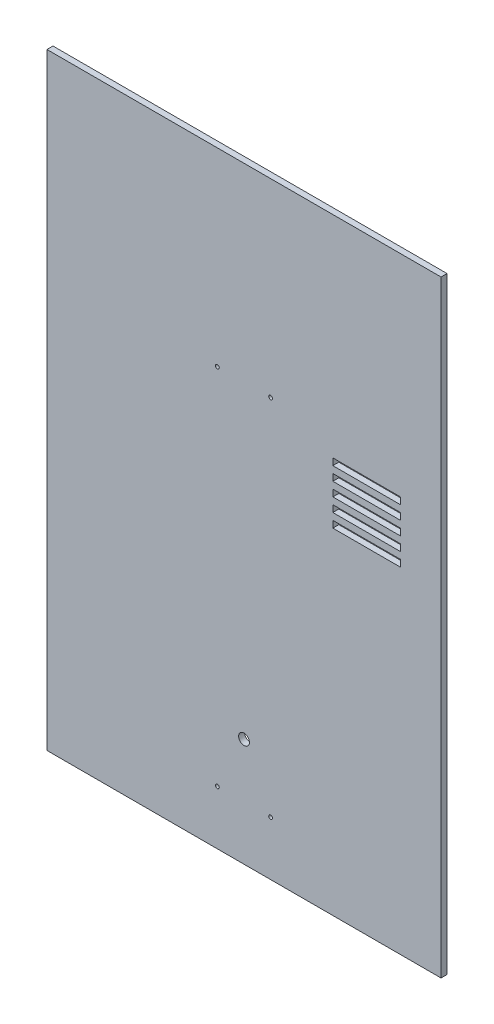
ISO-10303-21;
HEADER;
FILE_DESCRIPTION(('STEP AP214'),'2;1');
FILE_NAME('part.step','',(''),(''),'','','');
FILE_SCHEMA(('AUTOMOTIVE_DESIGN { 1 0 10303 214 1 1 1 1 }'));
ENDSEC;
DATA;
#1=APPLICATION_CONTEXT('core data for automotive mechanical design processes');
#2=APPLICATION_PROTOCOL_DEFINITION('international standard','automotive_design',2000,#1);
#3=PRODUCT_CONTEXT('',#1,'mechanical');
#4=PRODUCT('Part','Part','',(#3));
#5=PRODUCT_RELATED_PRODUCT_CATEGORY('part','',(#4));
#6=PRODUCT_DEFINITION_FORMATION('','',#4);
#7=PRODUCT_DEFINITION_CONTEXT('part definition',#1,'design');
#8=PRODUCT_DEFINITION('design','',#6,#7);
#9=PRODUCT_DEFINITION_SHAPE('','',#8);
#10=(LENGTH_UNIT() NAMED_UNIT(*) SI_UNIT(.MILLI.,.METRE.));
#11=(NAMED_UNIT(*) PLANE_ANGLE_UNIT() SI_UNIT($,.RADIAN.));
#12=(NAMED_UNIT(*) SI_UNIT($,.STERADIAN.) SOLID_ANGLE_UNIT());
#13=UNCERTAINTY_MEASURE_WITH_UNIT(LENGTH_MEASURE(1.E-05),#10,'distance_accuracy_value','');
#14=(GEOMETRIC_REPRESENTATION_CONTEXT(3) GLOBAL_UNCERTAINTY_ASSIGNED_CONTEXT((#13)) GLOBAL_UNIT_ASSIGNED_CONTEXT((#10,
#11,#12)) REPRESENTATION_CONTEXT('',''));
#15=CARTESIAN_POINT('',(0.,0.,0.));
#16=DIRECTION('',(0.,0.,1.));
#17=DIRECTION('',(1.,0.,0.));
#18=AXIS2_PLACEMENT_3D('',#15,#16,#17);
#19=CARTESIAN_POINT('',(-185.,570.,-2.81939999999998));
#20=DIRECTION('',(1.,0.,0.));
#21=DIRECTION('',(0.,0.,-1.));
#22=AXIS2_PLACEMENT_3D('',#19,#20,#21);
#23=PLANE('',#22);
#24=DIRECTION('',(0.,0.,1.));
#25=VECTOR('',#24,1.);
#26=CARTESIAN_POINT('',(-185.,0.,-2.81939999999998));
#27=LINE('',#26,#25);
#28=CARTESIAN_POINT('',(-185.,0.,-2.81939999999998));
#29=VERTEX_POINT('',#28);
#30=CARTESIAN_POINT('',(-185.,0.,2.81940000000002));
#31=VERTEX_POINT('',#30);
#32=EDGE_CURVE('E297',#29,#31,#27,.T.);
#33=ORIENTED_EDGE('',*,*,#32,.T.);
#34=DIRECTION('',(0.,-1.,0.));
#35=VECTOR('',#34,1.);
#36=CARTESIAN_POINT('',(-185.,570.,2.81940000000002));
#37=LINE('',#36,#35);
#38=CARTESIAN_POINT('',(-185.,570.,2.81940000000002));
#39=VERTEX_POINT('',#38);
#40=EDGE_CURVE('E326',#39,#31,#37,.T.);
#41=ORIENTED_EDGE('',*,*,#40,.F.);
#42=DIRECTION('',(0.,0.,1.));
#43=VECTOR('',#42,1.);
#44=CARTESIAN_POINT('',(-185.,570.,-2.81939999999998));
#45=LINE('',#44,#43);
#46=CARTESIAN_POINT('',(-185.,570.,-2.81939999999998));
#47=VERTEX_POINT('',#46);
#48=EDGE_CURVE('E300',#47,#39,#45,.T.);
#49=ORIENTED_EDGE('',*,*,#48,.F.);
#50=DIRECTION('',(0.,-1.,0.));
#51=VECTOR('',#50,1.);
#52=CARTESIAN_POINT('',(-185.,570.,-2.81939999999998));
#53=LINE('',#52,#51);
#54=EDGE_CURVE('E310',#47,#29,#53,.T.);
#55=ORIENTED_EDGE('',*,*,#54,.T.);
#56=EDGE_LOOP('',(#33,#41,#49,#55));
#57=FACE_BOUND('',#56,.T.);
#58=ADVANCED_FACE('F33',(#57),#23,.F.);
#59=CARTESIAN_POINT('',(185.,570.,2.81939999999998));
#60=DIRECTION('',(0.,0.,-1.));
#61=DIRECTION('',(-1.,0.,0.));
#62=AXIS2_PLACEMENT_3D('',#59,#60,#61);
#63=PLANE('',#62);
#64=DIRECTION('',(1.,0.,0.));
#65=VECTOR('',#64,1.);
#66=CARTESIAN_POINT('',(83.4,327.7,2.8194));
#67=LINE('',#66,#65);
#68=CARTESIAN_POINT('',(83.4,327.7,2.81939999999999));
#69=VERTEX_POINT('',#68);
#70=CARTESIAN_POINT('',(146.9,327.7,2.8194));
#71=VERTEX_POINT('',#70);
#72=EDGE_CURVE('E196',#69,#71,#67,.T.);
#73=ORIENTED_EDGE('',*,*,#72,.F.);
#74=DIRECTION('',(0.,-1.,0.));
#75=VECTOR('',#74,1.);
#76=CARTESIAN_POINT('',(83.4,334.05,2.8194));
#77=LINE('',#76,#75);
#78=CARTESIAN_POINT('',(83.4,334.05,2.8194));
#79=VERTEX_POINT('',#78);
#80=EDGE_CURVE('E232',#79,#69,#77,.T.);
#81=ORIENTED_EDGE('',*,*,#80,.F.);
#82=DIRECTION('',(-1.,0.,0.));
#83=VECTOR('',#82,1.);
#84=CARTESIAN_POINT('',(83.4,334.05,2.8194));
#85=LINE('',#84,#83);
#86=CARTESIAN_POINT('',(146.9,334.05,2.8194));
#87=VERTEX_POINT('',#86);
#88=EDGE_CURVE('E218',#87,#79,#85,.T.);
#89=ORIENTED_EDGE('',*,*,#88,.F.);
#90=DIRECTION('',(0.,1.,0.));
#91=VECTOR('',#90,1.);
#92=CARTESIAN_POINT('',(146.9,334.05,2.8194));
#93=LINE('',#92,#91);
#94=EDGE_CURVE('E210',#71,#87,#93,.T.);
#95=ORIENTED_EDGE('',*,*,#94,.F.);
#96=EDGE_LOOP('',(#73,#81,#89,#95));
#97=FACE_BOUND('',#96,.T.);
#98=DIRECTION('',(1.,0.,0.));
#99=VECTOR('',#98,1.);
#100=CARTESIAN_POINT('',(83.4,315.,2.8194));
#101=LINE('',#100,#99);
#102=CARTESIAN_POINT('',(83.4,315.,2.81939999999999));
#103=VERTEX_POINT('',#102);
#104=CARTESIAN_POINT('',(146.9,315.,2.8194));
#105=VERTEX_POINT('',#104);
#106=EDGE_CURVE('E253',#103,#105,#101,.T.);
#107=ORIENTED_EDGE('',*,*,#106,.F.);
#108=DIRECTION('',(0.,-1.,0.));
#109=VECTOR('',#108,1.);
#110=CARTESIAN_POINT('',(83.4,321.35,2.8194));
#111=LINE('',#110,#109);
#112=CARTESIAN_POINT('',(83.4,321.35,2.8194));
#113=VERTEX_POINT('',#112);
#114=EDGE_CURVE('E237',#113,#103,#111,.T.);
#115=ORIENTED_EDGE('',*,*,#114,.F.);
#116=DIRECTION('',(-1.,0.,0.));
#117=VECTOR('',#116,1.);
#118=CARTESIAN_POINT('',(83.4,321.35,2.8194));
#119=LINE('',#118,#117);
#120=CARTESIAN_POINT('',(146.9,321.35,2.8194));
#121=VERTEX_POINT('',#120);
#122=EDGE_CURVE('E242',#121,#113,#119,.T.);
#123=ORIENTED_EDGE('',*,*,#122,.F.);
#124=DIRECTION('',(0.,1.,0.));
#125=VECTOR('',#124,1.);
#126=CARTESIAN_POINT('',(146.9,321.35,2.8194));
#127=LINE('',#126,#125);
#128=EDGE_CURVE('E256',#105,#121,#127,.T.);
#129=ORIENTED_EDGE('',*,*,#128,.F.);
#130=EDGE_LOOP('',(#107,#115,#123,#129));
#131=FACE_BOUND('',#130,.T.);
#132=CARTESIAN_POINT('',(25.,392.,2.8194));
#133=DIRECTION('',(0.,0.,1.));
#134=DIRECTION('',(1.,0.,0.));
#135=AXIS2_PLACEMENT_3D('',#132,#133,#134);
#136=CIRCLE('',#135,1.77800000000002);
#137=CARTESIAN_POINT('',(26.778,392.,2.8194));
#138=VERTEX_POINT('',#137);
#139=EDGE_CURVE('E263',#138,#138,#136,.T.);
#140=ORIENTED_EDGE('',*,*,#139,.F.);
#141=EDGE_LOOP('',(#140));
#142=FACE_BOUND('',#141,.T.);
#143=CARTESIAN_POINT('',(-25.,392.,2.8194));
#144=DIRECTION('',(0.,0.,1.));
#145=DIRECTION('',(1.,0.,0.));
#146=AXIS2_PLACEMENT_3D('',#143,#144,#145);
#147=CIRCLE('',#146,1.77800000000002);
#148=CARTESIAN_POINT('',(-23.222,392.,2.8194));
#149=VERTEX_POINT('',#148);
#150=EDGE_CURVE('E273',#149,#149,#147,.T.);
#151=ORIENTED_EDGE('',*,*,#150,.F.);
#152=EDGE_LOOP('',(#151));
#153=FACE_BOUND('',#152,.T.);
#154=CARTESIAN_POINT('',(25.,50.8,2.8194));
#155=DIRECTION('',(0.,0.,1.));
#156=DIRECTION('',(1.,0.,0.));
#157=AXIS2_PLACEMENT_3D('',#154,#155,#156);
#158=CIRCLE('',#157,1.778);
#159=CARTESIAN_POINT('',(26.778,50.8,2.8194));
#160=VERTEX_POINT('',#159);
#161=EDGE_CURVE('E279',#160,#160,#158,.T.);
#162=ORIENTED_EDGE('',*,*,#161,.F.);
#163=EDGE_LOOP('',(#162));
#164=FACE_BOUND('',#163,.T.);
#165=CARTESIAN_POINT('',(-25.,50.8,2.8194));
#166=DIRECTION('',(0.,0.,1.));
#167=DIRECTION('',(1.,0.,0.));
#168=AXIS2_PLACEMENT_3D('',#165,#166,#167);
#169=CIRCLE('',#168,1.778);
#170=CARTESIAN_POINT('',(-23.222,50.8,2.8194));
#171=VERTEX_POINT('',#170);
#172=EDGE_CURVE('E285',#171,#171,#169,.T.);
#173=ORIENTED_EDGE('',*,*,#172,.F.);
#174=EDGE_LOOP('',(#173));
#175=FACE_BOUND('',#174,.T.);
#176=CARTESIAN_POINT('',(0.,101.6,2.8194));
#177=DIRECTION('',(0.,0.,1.));
#178=DIRECTION('',(1.,0.,0.));
#179=AXIS2_PLACEMENT_3D('',#176,#177,#178);
#180=CIRCLE('',#179,5.08);
#181=CARTESIAN_POINT('',(5.08,101.6,2.8194));
#182=VERTEX_POINT('',#181);
#183=EDGE_CURVE('E291',#182,#182,#180,.T.);
#184=ORIENTED_EDGE('',*,*,#183,.F.);
#185=EDGE_LOOP('',(#184));
#186=FACE_BOUND('',#185,.T.);
#187=DIRECTION('',(1.,0.,0.));
#188=VECTOR('',#187,1.);
#189=CARTESIAN_POINT('',(185.,0.,2.81939999999998));
#190=LINE('',#189,#188);
#191=CARTESIAN_POINT('',(185.,0.,2.81939999999998));
#192=VERTEX_POINT('',#191);
#193=EDGE_CURVE('E313',#31,#192,#190,.T.);
#194=ORIENTED_EDGE('',*,*,#193,.T.);
#195=DIRECTION('',(0.,-1.,0.));
#196=VECTOR('',#195,1.);
#197=CARTESIAN_POINT('',(185.,570.,2.81939999999998));
#198=LINE('',#197,#196);
#199=CARTESIAN_POINT('',(185.,570.,2.81939999999998));
#200=VERTEX_POINT('',#199);
#201=EDGE_CURVE('E323',#200,#192,#198,.T.);
#202=ORIENTED_EDGE('',*,*,#201,.F.);
#203=DIRECTION('',(1.,0.,0.));
#204=VECTOR('',#203,1.);
#205=CARTESIAN_POINT('',(185.,570.,2.81939999999998));
#206=LINE('',#205,#204);
#207=EDGE_CURVE('E303',#39,#200,#206,.T.);
#208=ORIENTED_EDGE('',*,*,#207,.F.);
#209=ORIENTED_EDGE('',*,*,#40,.T.);
#210=EDGE_LOOP('',(#194,#202,#208,#209));
#211=FACE_BOUND('',#210,.T.);
#212=DIRECTION('',(0.,-1.,0.));
#213=VECTOR('',#212,1.);
#214=CARTESIAN_POINT('',(83.4,346.75,2.8194));
#215=LINE('',#214,#213);
#216=CARTESIAN_POINT('',(83.4,346.75,2.8194));
#217=VERTEX_POINT('',#216);
#218=CARTESIAN_POINT('',(83.4,340.4,2.81939999999999));
#219=VERTEX_POINT('',#218);
#220=EDGE_CURVE('E329',#217,#219,#215,.T.);
#221=ORIENTED_EDGE('',*,*,#220,.F.);
#222=DIRECTION('',(-1.,0.,0.));
#223=VECTOR('',#222,1.);
#224=CARTESIAN_POINT('',(83.4,346.75,2.8194));
#225=LINE('',#224,#223);
#226=CARTESIAN_POINT('',(146.9,346.75,2.8194));
#227=VERTEX_POINT('',#226);
#228=EDGE_CURVE('E331',#227,#217,#225,.T.);
#229=ORIENTED_EDGE('',*,*,#228,.F.);
#230=DIRECTION('',(0.,1.,0.));
#231=VECTOR('',#230,1.);
#232=CARTESIAN_POINT('',(146.9,346.75,2.8194));
#233=LINE('',#232,#231);
#234=CARTESIAN_POINT('',(146.9,340.4,2.8194));
#235=VERTEX_POINT('',#234);
#236=EDGE_CURVE('E334',#235,#227,#233,.T.);
#237=ORIENTED_EDGE('',*,*,#236,.F.);
#238=DIRECTION('',(1.,0.,0.));
#239=VECTOR('',#238,1.);
#240=CARTESIAN_POINT('',(83.4,340.4,2.8194));
#241=LINE('',#240,#239);
#242=EDGE_CURVE('E337',#219,#235,#241,.T.);
#243=ORIENTED_EDGE('',*,*,#242,.F.);
#244=EDGE_LOOP('',(#221,#229,#237,#243));
#245=FACE_BOUND('',#244,.T.);
#246=DIRECTION('',(0.,-1.,0.));
#247=VECTOR('',#246,1.);
#248=CARTESIAN_POINT('',(83.4,359.45,2.8194));
#249=LINE('',#248,#247);
#250=CARTESIAN_POINT('',(83.4,359.45,2.8194));
#251=VERTEX_POINT('',#250);
#252=CARTESIAN_POINT('',(83.4,353.1,2.81939999999999));
#253=VERTEX_POINT('',#252);
#254=EDGE_CURVE('E361',#251,#253,#249,.T.);
#255=ORIENTED_EDGE('',*,*,#254,.F.);
#256=DIRECTION('',(-1.,0.,0.));
#257=VECTOR('',#256,1.);
#258=CARTESIAN_POINT('',(83.4,359.45,2.8194));
#259=LINE('',#258,#257);
#260=CARTESIAN_POINT('',(146.9,359.45,2.8194));
#261=VERTEX_POINT('',#260);
#262=EDGE_CURVE('E363',#261,#251,#259,.T.);
#263=ORIENTED_EDGE('',*,*,#262,.F.);
#264=DIRECTION('',(0.,1.,0.));
#265=VECTOR('',#264,1.);
#266=CARTESIAN_POINT('',(146.9,359.45,2.8194));
#267=LINE('',#266,#265);
#268=CARTESIAN_POINT('',(146.9,353.1,2.8194));
#269=VERTEX_POINT('',#268);
#270=EDGE_CURVE('E366',#269,#261,#267,.T.);
#271=ORIENTED_EDGE('',*,*,#270,.F.);
#272=DIRECTION('',(1.,0.,0.));
#273=VECTOR('',#272,1.);
#274=CARTESIAN_POINT('',(83.4,353.1,2.8194));
#275=LINE('',#274,#273);
#276=EDGE_CURVE('E369',#253,#269,#275,.T.);
#277=ORIENTED_EDGE('',*,*,#276,.F.);
#278=EDGE_LOOP('',(#255,#263,#271,#277));
#279=FACE_BOUND('',#278,.T.);
#280=DIRECTION('',(0.,-1.,0.));
#281=VECTOR('',#280,1.);
#282=CARTESIAN_POINT('',(83.4,372.15,2.8194));
#283=LINE('',#282,#281);
#284=CARTESIAN_POINT('',(83.4,372.15,2.8194));
#285=VERTEX_POINT('',#284);
#286=CARTESIAN_POINT('',(83.4,365.8,2.81939999999999));
#287=VERTEX_POINT('',#286);
#288=EDGE_CURVE('E393',#285,#287,#283,.T.);
#289=ORIENTED_EDGE('',*,*,#288,.F.);
#290=DIRECTION('',(-1.,0.,0.));
#291=VECTOR('',#290,1.);
#292=CARTESIAN_POINT('',(83.4,372.15,2.8194));
#293=LINE('',#292,#291);
#294=CARTESIAN_POINT('',(146.9,372.15,2.8194));
#295=VERTEX_POINT('',#294);
#296=EDGE_CURVE('E395',#295,#285,#293,.T.);
#297=ORIENTED_EDGE('',*,*,#296,.F.);
#298=DIRECTION('',(0.,1.,0.));
#299=VECTOR('',#298,1.);
#300=CARTESIAN_POINT('',(146.9,372.15,2.8194));
#301=LINE('',#300,#299);
#302=CARTESIAN_POINT('',(146.9,365.8,2.8194));
#303=VERTEX_POINT('',#302);
#304=EDGE_CURVE('E398',#303,#295,#301,.T.);
#305=ORIENTED_EDGE('',*,*,#304,.F.);
#306=DIRECTION('',(1.,0.,0.));
#307=VECTOR('',#306,1.);
#308=CARTESIAN_POINT('',(83.4,365.8,2.8194));
#309=LINE('',#308,#307);
#310=EDGE_CURVE('E401',#287,#303,#309,.T.);
#311=ORIENTED_EDGE('',*,*,#310,.F.);
#312=EDGE_LOOP('',(#289,#297,#305,#311));
#313=FACE_BOUND('',#312,.T.);
#314=ADVANCED_FACE('F216',(#97,#131,#142,#153,#164,#175,#186,#211,#245,#279,#313),#63,.F.);
#315=CARTESIAN_POINT('',(185.,570.,-2.81940000000002));
#316=DIRECTION('',(-1.,0.,0.));
#317=DIRECTION('',(0.,0.,1.));
#318=AXIS2_PLACEMENT_3D('',#315,#316,#317);
#319=PLANE('',#318);
#320=DIRECTION('',(0.,0.,-1.));
#321=VECTOR('',#320,1.);
#322=CARTESIAN_POINT('',(185.,0.,-2.81940000000002));
#323=LINE('',#322,#321);
#324=CARTESIAN_POINT('',(185.,0.,-2.81940000000002));
#325=VERTEX_POINT('',#324);
#326=EDGE_CURVE('E315',#192,#325,#323,.T.);
#327=ORIENTED_EDGE('',*,*,#326,.T.);
#328=DIRECTION('',(0.,-1.,0.));
#329=VECTOR('',#328,1.);
#330=CARTESIAN_POINT('',(185.,570.,-2.81940000000002));
#331=LINE('',#330,#329);
#332=CARTESIAN_POINT('',(185.,570.,-2.81940000000002));
#333=VERTEX_POINT('',#332);
#334=EDGE_CURVE('E320',#333,#325,#331,.T.);
#335=ORIENTED_EDGE('',*,*,#334,.F.);
#336=DIRECTION('',(0.,0.,-1.));
#337=VECTOR('',#336,1.);
#338=CARTESIAN_POINT('',(185.,570.,-2.81940000000002));
#339=LINE('',#338,#337);
#340=EDGE_CURVE('E306',#200,#333,#339,.T.);
#341=ORIENTED_EDGE('',*,*,#340,.F.);
#342=ORIENTED_EDGE('',*,*,#201,.T.);
#343=EDGE_LOOP('',(#327,#335,#341,#342));
#344=FACE_BOUND('',#343,.T.);
#345=ADVANCED_FACE('F441',(#344),#319,.F.);
#346=CARTESIAN_POINT('',(185.,570.,-2.81940000000002));
#347=DIRECTION('',(0.,0.,1.));
#348=DIRECTION('',(1.,0.,0.));
#349=AXIS2_PLACEMENT_3D('',#346,#347,#348);
#350=PLANE('',#349);
#351=DIRECTION('',(-1.,0.,0.));
#352=VECTOR('',#351,1.);
#353=CARTESIAN_POINT('',(83.4,334.05,-2.81940000000002));
#354=LINE('',#353,#352);
#355=CARTESIAN_POINT('',(146.9,334.05,-2.81940000000002));
#356=VERTEX_POINT('',#355);
#357=CARTESIAN_POINT('',(83.4,334.05,-2.81940000000002));
#358=VERTEX_POINT('',#357);
#359=EDGE_CURVE('E229',#356,#358,#354,.T.);
#360=ORIENTED_EDGE('',*,*,#359,.T.);
#361=DIRECTION('',(0.,-1.,0.));
#362=VECTOR('',#361,1.);
#363=CARTESIAN_POINT('',(83.4,334.05,-2.81940000000002));
#364=LINE('',#363,#362);
#365=CARTESIAN_POINT('',(83.4,327.7,-2.81940000000002));
#366=VERTEX_POINT('',#365);
#367=EDGE_CURVE('E234',#358,#366,#364,.T.);
#368=ORIENTED_EDGE('',*,*,#367,.T.);
#369=DIRECTION('',(1.,0.,0.));
#370=VECTOR('',#369,1.);
#371=CARTESIAN_POINT('',(83.4,327.7,-2.81940000000002));
#372=LINE('',#371,#370);
#373=CARTESIAN_POINT('',(146.9,327.7,-2.81940000000002));
#374=VERTEX_POINT('',#373);
#375=EDGE_CURVE('E206',#366,#374,#372,.T.);
#376=ORIENTED_EDGE('',*,*,#375,.T.);
#377=DIRECTION('',(0.,1.,0.));
#378=VECTOR('',#377,1.);
#379=CARTESIAN_POINT('',(146.9,334.05,-2.81940000000002));
#380=LINE('',#379,#378);
#381=EDGE_CURVE('E213',#374,#356,#380,.T.);
#382=ORIENTED_EDGE('',*,*,#381,.T.);
#383=EDGE_LOOP('',(#360,#368,#376,#382));
#384=FACE_BOUND('',#383,.T.);
#385=DIRECTION('',(-1.,0.,0.));
#386=VECTOR('',#385,1.);
#387=CARTESIAN_POINT('',(83.4,321.35,-2.81940000000002));
#388=LINE('',#387,#386);
#389=CARTESIAN_POINT('',(146.9,321.35,-2.81940000000002));
#390=VERTEX_POINT('',#389);
#391=CARTESIAN_POINT('',(83.4,321.35,-2.81940000000002));
#392=VERTEX_POINT('',#391);
#393=EDGE_CURVE('E248',#390,#392,#388,.T.);
#394=ORIENTED_EDGE('',*,*,#393,.T.);
#395=DIRECTION('',(0.,-1.,0.));
#396=VECTOR('',#395,1.);
#397=CARTESIAN_POINT('',(83.4,321.35,-2.81940000000002));
#398=LINE('',#397,#396);
#399=CARTESIAN_POINT('',(83.4,315.,-2.81940000000002));
#400=VERTEX_POINT('',#399);
#401=EDGE_CURVE('E238',#392,#400,#398,.T.);
#402=ORIENTED_EDGE('',*,*,#401,.T.);
#403=DIRECTION('',(1.,0.,0.));
#404=VECTOR('',#403,1.);
#405=CARTESIAN_POINT('',(83.4,315.,-2.81940000000002));
#406=LINE('',#405,#404);
#407=CARTESIAN_POINT('',(146.9,315.,-2.81940000000002));
#408=VERTEX_POINT('',#407);
#409=EDGE_CURVE('E241',#400,#408,#406,.T.);
#410=ORIENTED_EDGE('',*,*,#409,.T.);
#411=DIRECTION('',(0.,1.,0.));
#412=VECTOR('',#411,1.);
#413=CARTESIAN_POINT('',(146.9,321.35,-2.81940000000002));
#414=LINE('',#413,#412);
#415=EDGE_CURVE('E245',#408,#390,#414,.T.);
#416=ORIENTED_EDGE('',*,*,#415,.T.);
#417=EDGE_LOOP('',(#394,#402,#410,#416));
#418=FACE_BOUND('',#417,.T.);
#419=CARTESIAN_POINT('',(25.,392.,-2.81940000000002));
#420=DIRECTION('',(0.,0.,1.));
#421=DIRECTION('',(1.,0.,0.));
#422=AXIS2_PLACEMENT_3D('',#419,#420,#421);
#423=CIRCLE('',#422,1.77800000000002);
#424=CARTESIAN_POINT('',(26.778,392.,-2.81940000000002));
#425=VERTEX_POINT('',#424);
#426=EDGE_CURVE('E270',#425,#425,#423,.T.);
#427=ORIENTED_EDGE('',*,*,#426,.T.);
#428=EDGE_LOOP('',(#427));
#429=FACE_BOUND('',#428,.T.);
#430=CARTESIAN_POINT('',(-25.,392.,-2.81940000000002));
#431=DIRECTION('',(0.,0.,1.));
#432=DIRECTION('',(1.,0.,0.));
#433=AXIS2_PLACEMENT_3D('',#430,#431,#432);
#434=CIRCLE('',#433,1.77800000000002);
#435=CARTESIAN_POINT('',(-23.222,392.,-2.81940000000002));
#436=VERTEX_POINT('',#435);
#437=EDGE_CURVE('E276',#436,#436,#434,.T.);
#438=ORIENTED_EDGE('',*,*,#437,.T.);
#439=EDGE_LOOP('',(#438));
#440=FACE_BOUND('',#439,.T.);
#441=CARTESIAN_POINT('',(25.,50.8,-2.81940000000002));
#442=DIRECTION('',(0.,0.,1.));
#443=DIRECTION('',(1.,0.,0.));
#444=AXIS2_PLACEMENT_3D('',#441,#442,#443);
#445=CIRCLE('',#444,1.778);
#446=CARTESIAN_POINT('',(26.778,50.8,-2.81940000000002));
#447=VERTEX_POINT('',#446);
#448=EDGE_CURVE('E282',#447,#447,#445,.T.);
#449=ORIENTED_EDGE('',*,*,#448,.T.);
#450=EDGE_LOOP('',(#449));
#451=FACE_BOUND('',#450,.T.);
#452=CARTESIAN_POINT('',(-25.,50.8,-2.81940000000002));
#453=DIRECTION('',(0.,0.,1.));
#454=DIRECTION('',(1.,0.,0.));
#455=AXIS2_PLACEMENT_3D('',#452,#453,#454);
#456=CIRCLE('',#455,1.778);
#457=CARTESIAN_POINT('',(-23.222,50.8,-2.81940000000002));
#458=VERTEX_POINT('',#457);
#459=EDGE_CURVE('E288',#458,#458,#456,.T.);
#460=ORIENTED_EDGE('',*,*,#459,.T.);
#461=EDGE_LOOP('',(#460));
#462=FACE_BOUND('',#461,.T.);
#463=CARTESIAN_POINT('',(0.,101.6,-2.81940000000002));
#464=DIRECTION('',(0.,0.,1.));
#465=DIRECTION('',(1.,0.,0.));
#466=AXIS2_PLACEMENT_3D('',#463,#464,#465);
#467=CIRCLE('',#466,5.08);
#468=CARTESIAN_POINT('',(5.08,101.6,-2.81940000000002));
#469=VERTEX_POINT('',#468);
#470=EDGE_CURVE('E294',#469,#469,#467,.T.);
#471=ORIENTED_EDGE('',*,*,#470,.T.);
#472=EDGE_LOOP('',(#471));
#473=FACE_BOUND('',#472,.T.);
#474=DIRECTION('',(-1.,0.,0.));
#475=VECTOR('',#474,1.);
#476=CARTESIAN_POINT('',(185.,0.,-2.81940000000002));
#477=LINE('',#476,#475);
#478=EDGE_CURVE('E304',#325,#29,#477,.T.);
#479=ORIENTED_EDGE('',*,*,#478,.T.);
#480=ORIENTED_EDGE('',*,*,#54,.F.);
#481=DIRECTION('',(-1.,0.,0.));
#482=VECTOR('',#481,1.);
#483=CARTESIAN_POINT('',(185.,570.,-2.81940000000002));
#484=LINE('',#483,#482);
#485=EDGE_CURVE('E308',#333,#47,#484,.T.);
#486=ORIENTED_EDGE('',*,*,#485,.F.);
#487=ORIENTED_EDGE('',*,*,#334,.T.);
#488=EDGE_LOOP('',(#479,#480,#486,#487));
#489=FACE_BOUND('',#488,.T.);
#490=DIRECTION('',(0.,-1.,0.));
#491=VECTOR('',#490,1.);
#492=CARTESIAN_POINT('',(83.4,346.75,-2.81940000000002));
#493=LINE('',#492,#491);
#494=CARTESIAN_POINT('',(83.4,346.75,-2.81940000000002));
#495=VERTEX_POINT('',#494);
#496=CARTESIAN_POINT('',(83.4,340.4,-2.81940000000002));
#497=VERTEX_POINT('',#496);
#498=EDGE_CURVE('E340',#495,#497,#493,.T.);
#499=ORIENTED_EDGE('',*,*,#498,.T.);
#500=DIRECTION('',(1.,0.,0.));
#501=VECTOR('',#500,1.);
#502=CARTESIAN_POINT('',(83.4,340.4,-2.81940000000002));
#503=LINE('',#502,#501);
#504=CARTESIAN_POINT('',(146.9,340.4,-2.81940000000002));
#505=VERTEX_POINT('',#504);
#506=EDGE_CURVE('E342',#497,#505,#503,.T.);
#507=ORIENTED_EDGE('',*,*,#506,.T.);
#508=DIRECTION('',(0.,1.,0.));
#509=VECTOR('',#508,1.);
#510=CARTESIAN_POINT('',(146.9,346.75,-2.81940000000002));
#511=LINE('',#510,#509);
#512=CARTESIAN_POINT('',(146.9,346.75,-2.81940000000002));
#513=VERTEX_POINT('',#512);
#514=EDGE_CURVE('E344',#505,#513,#511,.T.);
#515=ORIENTED_EDGE('',*,*,#514,.T.);
#516=DIRECTION('',(-1.,0.,0.));
#517=VECTOR('',#516,1.);
#518=CARTESIAN_POINT('',(83.4,346.75,-2.81940000000002));
#519=LINE('',#518,#517);
#520=EDGE_CURVE('E346',#513,#495,#519,.T.);
#521=ORIENTED_EDGE('',*,*,#520,.T.);
#522=EDGE_LOOP('',(#499,#507,#515,#521));
#523=FACE_BOUND('',#522,.T.);
#524=DIRECTION('',(0.,-1.,0.));
#525=VECTOR('',#524,1.);
#526=CARTESIAN_POINT('',(83.4,359.45,-2.81940000000002));
#527=LINE('',#526,#525);
#528=CARTESIAN_POINT('',(83.4,359.45,-2.81940000000002));
#529=VERTEX_POINT('',#528);
#530=CARTESIAN_POINT('',(83.4,353.1,-2.81940000000002));
#531=VERTEX_POINT('',#530);
#532=EDGE_CURVE('E372',#529,#531,#527,.T.);
#533=ORIENTED_EDGE('',*,*,#532,.T.);
#534=DIRECTION('',(1.,0.,0.));
#535=VECTOR('',#534,1.);
#536=CARTESIAN_POINT('',(83.4,353.1,-2.81940000000002));
#537=LINE('',#536,#535);
#538=CARTESIAN_POINT('',(146.9,353.1,-2.81940000000002));
#539=VERTEX_POINT('',#538);
#540=EDGE_CURVE('E374',#531,#539,#537,.T.);
#541=ORIENTED_EDGE('',*,*,#540,.T.);
#542=DIRECTION('',(0.,1.,0.));
#543=VECTOR('',#542,1.);
#544=CARTESIAN_POINT('',(146.9,359.45,-2.81940000000002));
#545=LINE('',#544,#543);
#546=CARTESIAN_POINT('',(146.9,359.45,-2.81940000000002));
#547=VERTEX_POINT('',#546);
#548=EDGE_CURVE('E376',#539,#547,#545,.T.);
#549=ORIENTED_EDGE('',*,*,#548,.T.);
#550=DIRECTION('',(-1.,0.,0.));
#551=VECTOR('',#550,1.);
#552=CARTESIAN_POINT('',(83.4,359.45,-2.81940000000002));
#553=LINE('',#552,#551);
#554=EDGE_CURVE('E378',#547,#529,#553,.T.);
#555=ORIENTED_EDGE('',*,*,#554,.T.);
#556=EDGE_LOOP('',(#533,#541,#549,#555));
#557=FACE_BOUND('',#556,.T.);
#558=DIRECTION('',(0.,-1.,0.));
#559=VECTOR('',#558,1.);
#560=CARTESIAN_POINT('',(83.4,372.15,-2.81940000000002));
#561=LINE('',#560,#559);
#562=CARTESIAN_POINT('',(83.4,372.15,-2.81940000000002));
#563=VERTEX_POINT('',#562);
#564=CARTESIAN_POINT('',(83.4,365.8,-2.81940000000002));
#565=VERTEX_POINT('',#564);
#566=EDGE_CURVE('E48',#563,#565,#561,.T.);
#567=ORIENTED_EDGE('',*,*,#566,.T.);
#568=DIRECTION('',(1.,0.,0.));
#569=VECTOR('',#568,1.);
#570=CARTESIAN_POINT('',(83.4,365.8,-2.81940000000002));
#571=LINE('',#570,#569);
#572=CARTESIAN_POINT('',(146.9,365.8,-2.81940000000002));
#573=VERTEX_POINT('',#572);
#574=EDGE_CURVE('E405',#565,#573,#571,.T.);
#575=ORIENTED_EDGE('',*,*,#574,.T.);
#576=DIRECTION('',(0.,1.,0.));
#577=VECTOR('',#576,1.);
#578=CARTESIAN_POINT('',(146.9,372.15,-2.81940000000002));
#579=LINE('',#578,#577);
#580=CARTESIAN_POINT('',(146.9,372.15,-2.81940000000002));
#581=VERTEX_POINT('',#580);
#582=EDGE_CURVE('E55',#573,#581,#579,.T.);
#583=ORIENTED_EDGE('',*,*,#582,.T.);
#584=DIRECTION('',(-1.,0.,0.));
#585=VECTOR('',#584,1.);
#586=CARTESIAN_POINT('',(83.4,372.15,-2.81940000000002));
#587=LINE('',#586,#585);
#588=EDGE_CURVE('E408',#581,#563,#587,.T.);
#589=ORIENTED_EDGE('',*,*,#588,.T.);
#590=EDGE_LOOP('',(#567,#575,#583,#589));
#591=FACE_BOUND('',#590,.T.);
#592=ADVANCED_FACE('F486',(#384,#418,#429,#440,#451,#462,#473,#489,#523,#557,#591),#350,.F.);
#593=CARTESIAN_POINT('',(0.,570.,0.));
#594=DIRECTION('',(0.,-1.,0.));
#595=DIRECTION('',(0.,0.,-1.));
#596=AXIS2_PLACEMENT_3D('',#593,#594,#595);
#597=PLANE('',#596);
#598=ORIENTED_EDGE('',*,*,#48,.T.);
#599=ORIENTED_EDGE('',*,*,#207,.T.);
#600=ORIENTED_EDGE('',*,*,#340,.T.);
#601=ORIENTED_EDGE('',*,*,#485,.T.);
#602=EDGE_LOOP('',(#598,#599,#600,#601));
#603=FACE_BOUND('',#602,.T.);
#604=ADVANCED_FACE('F489',(#603),#597,.F.);
#605=CARTESIAN_POINT('',(0.,0.,0.));
#606=DIRECTION('',(0.,-1.,0.));
#607=DIRECTION('',(0.,0.,-1.));
#608=AXIS2_PLACEMENT_3D('',#605,#606,#607);
#609=PLANE('',#608);
#610=ORIENTED_EDGE('',*,*,#32,.F.);
#611=ORIENTED_EDGE('',*,*,#478,.F.);
#612=ORIENTED_EDGE('',*,*,#326,.F.);
#613=ORIENTED_EDGE('',*,*,#193,.F.);
#614=EDGE_LOOP('',(#610,#611,#612,#613));
#615=FACE_BOUND('',#614,.T.);
#616=ADVANCED_FACE('F496',(#615),#609,.T.);
#617=CARTESIAN_POINT('',(0.,101.6,-2.81940000000002));
#618=DIRECTION('',(0.,0.,1.));
#619=DIRECTION('',(1.,0.,0.));
#620=AXIS2_PLACEMENT_3D('',#617,#618,#619);
#621=CYLINDRICAL_SURFACE('',#620,5.08);
#622=ORIENTED_EDGE('',*,*,#470,.F.);
#623=EDGE_LOOP('',(#622));
#624=FACE_BOUND('',#623,.T.);
#625=ORIENTED_EDGE('',*,*,#183,.T.);
#626=EDGE_LOOP('',(#625));
#627=FACE_BOUND('',#626,.T.);
#628=ADVANCED_FACE('F504',(#624,#627),#621,.F.);
#629=CARTESIAN_POINT('',(-25.,50.8,-2.81940000000002));
#630=DIRECTION('',(0.,0.,1.));
#631=DIRECTION('',(1.,0.,0.));
#632=AXIS2_PLACEMENT_3D('',#629,#630,#631);
#633=CYLINDRICAL_SURFACE('',#632,1.778);
#634=ORIENTED_EDGE('',*,*,#459,.F.);
#635=EDGE_LOOP('',(#634));
#636=FACE_BOUND('',#635,.T.);
#637=ORIENTED_EDGE('',*,*,#172,.T.);
#638=EDGE_LOOP('',(#637));
#639=FACE_BOUND('',#638,.T.);
#640=ADVANCED_FACE('F509',(#636,#639),#633,.F.);
#641=CARTESIAN_POINT('',(25.,50.8,-2.81940000000002));
#642=DIRECTION('',(0.,0.,1.));
#643=DIRECTION('',(1.,0.,0.));
#644=AXIS2_PLACEMENT_3D('',#641,#642,#643);
#645=CYLINDRICAL_SURFACE('',#644,1.778);
#646=ORIENTED_EDGE('',*,*,#448,.F.);
#647=EDGE_LOOP('',(#646));
#648=FACE_BOUND('',#647,.T.);
#649=ORIENTED_EDGE('',*,*,#161,.T.);
#650=EDGE_LOOP('',(#649));
#651=FACE_BOUND('',#650,.T.);
#652=ADVANCED_FACE('F513',(#648,#651),#645,.F.);
#653=CARTESIAN_POINT('',(-25.,392.,-2.81940000000002));
#654=DIRECTION('',(0.,0.,1.));
#655=DIRECTION('',(1.,0.,0.));
#656=AXIS2_PLACEMENT_3D('',#653,#654,#655);
#657=CYLINDRICAL_SURFACE('',#656,1.77800000000002);
#658=ORIENTED_EDGE('',*,*,#437,.F.);
#659=EDGE_LOOP('',(#658));
#660=FACE_BOUND('',#659,.T.);
#661=ORIENTED_EDGE('',*,*,#150,.T.);
#662=EDGE_LOOP('',(#661));
#663=FACE_BOUND('',#662,.T.);
#664=ADVANCED_FACE('F517',(#660,#663),#657,.F.);
#665=CARTESIAN_POINT('',(25.,392.,-2.81940000000002));
#666=DIRECTION('',(0.,0.,1.));
#667=DIRECTION('',(1.,0.,0.));
#668=AXIS2_PLACEMENT_3D('',#665,#666,#667);
#669=CYLINDRICAL_SURFACE('',#668,1.77800000000002);
#670=ORIENTED_EDGE('',*,*,#426,.F.);
#671=EDGE_LOOP('',(#670));
#672=FACE_BOUND('',#671,.T.);
#673=ORIENTED_EDGE('',*,*,#139,.T.);
#674=EDGE_LOOP('',(#673));
#675=FACE_BOUND('',#674,.T.);
#676=ADVANCED_FACE('F521',(#672,#675),#669,.F.);
#677=CARTESIAN_POINT('',(83.4,321.35,-2.81940000000002));
#678=DIRECTION('',(-1.,0.,0.));
#679=DIRECTION('',(0.,0.,1.));
#680=AXIS2_PLACEMENT_3D('',#677,#678,#679);
#681=PLANE('',#680);
#682=ORIENTED_EDGE('',*,*,#114,.T.);
#683=DIRECTION('',(0.,0.,1.));
#684=VECTOR('',#683,1.);
#685=CARTESIAN_POINT('',(83.4,315.,-2.81940000000002));
#686=LINE('',#685,#684);
#687=EDGE_CURVE('E251',#400,#103,#686,.T.);
#688=ORIENTED_EDGE('',*,*,#687,.F.);
#689=ORIENTED_EDGE('',*,*,#401,.F.);
#690=DIRECTION('',(0.,0.,1.));
#691=VECTOR('',#690,1.);
#692=CARTESIAN_POINT('',(83.4,321.35,-2.81940000000002));
#693=LINE('',#692,#691);
#694=EDGE_CURVE('E261',#392,#113,#693,.T.);
#695=ORIENTED_EDGE('',*,*,#694,.T.);
#696=EDGE_LOOP('',(#682,#688,#689,#695));
#697=FACE_BOUND('',#696,.T.);
#698=ADVANCED_FACE('F525',(#697),#681,.F.);
#699=CARTESIAN_POINT('',(83.4,321.35,-2.81940000000002));
#700=DIRECTION('',(0.,1.,0.));
#701=DIRECTION('',(0.,0.,1.));
#702=AXIS2_PLACEMENT_3D('',#699,#700,#701);
#703=PLANE('',#702);
#704=ORIENTED_EDGE('',*,*,#122,.T.);
#705=ORIENTED_EDGE('',*,*,#694,.F.);
#706=ORIENTED_EDGE('',*,*,#393,.F.);
#707=DIRECTION('',(0.,0.,1.));
#708=VECTOR('',#707,1.);
#709=CARTESIAN_POINT('',(146.9,321.35,-2.81940000000002));
#710=LINE('',#709,#708);
#711=EDGE_CURVE('E264',#390,#121,#710,.T.);
#712=ORIENTED_EDGE('',*,*,#711,.T.);
#713=EDGE_LOOP('',(#704,#705,#706,#712));
#714=FACE_BOUND('',#713,.T.);
#715=ADVANCED_FACE('F529',(#714),#703,.F.);
#716=CARTESIAN_POINT('',(146.9,321.35,-2.81940000000002));
#717=DIRECTION('',(1.,0.,0.));
#718=DIRECTION('',(0.,0.,-1.));
#719=AXIS2_PLACEMENT_3D('',#716,#717,#718);
#720=PLANE('',#719);
#721=ORIENTED_EDGE('',*,*,#128,.T.);
#722=ORIENTED_EDGE('',*,*,#711,.F.);
#723=ORIENTED_EDGE('',*,*,#415,.F.);
#724=DIRECTION('',(0.,0.,1.));
#725=VECTOR('',#724,1.);
#726=CARTESIAN_POINT('',(146.9,315.,-2.81940000000002));
#727=LINE('',#726,#725);
#728=EDGE_CURVE('E266',#408,#105,#727,.T.);
#729=ORIENTED_EDGE('',*,*,#728,.T.);
#730=EDGE_LOOP('',(#721,#722,#723,#729));
#731=FACE_BOUND('',#730,.T.);
#732=ADVANCED_FACE('F535',(#731),#720,.F.);
#733=CARTESIAN_POINT('',(83.4,315.,-2.81940000000002));
#734=DIRECTION('',(0.,-1.,0.));
#735=DIRECTION('',(0.,0.,-1.));
#736=AXIS2_PLACEMENT_3D('',#733,#734,#735);
#737=PLANE('',#736);
#738=ORIENTED_EDGE('',*,*,#106,.T.);
#739=ORIENTED_EDGE('',*,*,#728,.F.);
#740=ORIENTED_EDGE('',*,*,#409,.F.);
#741=ORIENTED_EDGE('',*,*,#687,.T.);
#742=EDGE_LOOP('',(#738,#739,#740,#741));
#743=FACE_BOUND('',#742,.T.);
#744=ADVANCED_FACE('F531',(#743),#737,.F.);
#745=CARTESIAN_POINT('',(83.4,334.05,-2.81940000000002));
#746=DIRECTION('',(-1.,0.,0.));
#747=DIRECTION('',(0.,0.,1.));
#748=AXIS2_PLACEMENT_3D('',#745,#746,#747);
#749=PLANE('',#748);
#750=ORIENTED_EDGE('',*,*,#80,.T.);
#751=DIRECTION('',(0.,0.,1.));
#752=VECTOR('',#751,1.);
#753=CARTESIAN_POINT('',(83.4,327.7,-2.81940000000002));
#754=LINE('',#753,#752);
#755=EDGE_CURVE('E202',#366,#69,#754,.T.);
#756=ORIENTED_EDGE('',*,*,#755,.F.);
#757=ORIENTED_EDGE('',*,*,#367,.F.);
#758=DIRECTION('',(0.,0.,1.));
#759=VECTOR('',#758,1.);
#760=CARTESIAN_POINT('',(83.4,334.05,-2.81940000000002));
#761=LINE('',#760,#759);
#762=EDGE_CURVE('E226',#358,#79,#761,.T.);
#763=ORIENTED_EDGE('',*,*,#762,.T.);
#764=EDGE_LOOP('',(#750,#756,#757,#763));
#765=FACE_BOUND('',#764,.T.);
#766=ADVANCED_FACE('F534',(#765),#749,.F.);
#767=CARTESIAN_POINT('',(83.4,334.05,-2.81940000000002));
#768=DIRECTION('',(0.,1.,0.));
#769=DIRECTION('',(0.,0.,1.));
#770=AXIS2_PLACEMENT_3D('',#767,#768,#769);
#771=PLANE('',#770);
#772=ORIENTED_EDGE('',*,*,#88,.T.);
#773=ORIENTED_EDGE('',*,*,#762,.F.);
#774=ORIENTED_EDGE('',*,*,#359,.F.);
#775=DIRECTION('',(0.,0.,1.));
#776=VECTOR('',#775,1.);
#777=CARTESIAN_POINT('',(146.9,334.05,-2.81940000000002));
#778=LINE('',#777,#776);
#779=EDGE_CURVE('E219',#356,#87,#778,.T.);
#780=ORIENTED_EDGE('',*,*,#779,.T.);
#781=EDGE_LOOP('',(#772,#773,#774,#780));
#782=FACE_BOUND('',#781,.T.);
#783=ADVANCED_FACE('F545',(#782),#771,.F.);
#784=CARTESIAN_POINT('',(146.9,334.05,-2.81940000000002));
#785=DIRECTION('',(1.,0.,0.));
#786=DIRECTION('',(0.,0.,-1.));
#787=AXIS2_PLACEMENT_3D('',#784,#785,#786);
#788=PLANE('',#787);
#789=ORIENTED_EDGE('',*,*,#94,.T.);
#790=ORIENTED_EDGE('',*,*,#779,.F.);
#791=ORIENTED_EDGE('',*,*,#381,.F.);
#792=DIRECTION('',(0.,0.,1.));
#793=VECTOR('',#792,1.);
#794=CARTESIAN_POINT('',(146.9,327.7,-2.81940000000002));
#795=LINE('',#794,#793);
#796=EDGE_CURVE('E199',#374,#71,#795,.T.);
#797=ORIENTED_EDGE('',*,*,#796,.T.);
#798=EDGE_LOOP('',(#789,#790,#791,#797));
#799=FACE_BOUND('',#798,.T.);
#800=ADVANCED_FACE('F209',(#799),#788,.F.);
#801=CARTESIAN_POINT('',(83.4,327.7,-2.81940000000002));
#802=DIRECTION('',(0.,-1.,0.));
#803=DIRECTION('',(0.,0.,-1.));
#804=AXIS2_PLACEMENT_3D('',#801,#802,#803);
#805=PLANE('',#804);
#806=ORIENTED_EDGE('',*,*,#72,.T.);
#807=ORIENTED_EDGE('',*,*,#796,.F.);
#808=ORIENTED_EDGE('',*,*,#375,.F.);
#809=ORIENTED_EDGE('',*,*,#755,.T.);
#810=EDGE_LOOP('',(#806,#807,#808,#809));
#811=FACE_BOUND('',#810,.T.);
#812=ADVANCED_FACE('F198',(#811),#805,.F.);
#813=CARTESIAN_POINT('',(83.4,340.4,-2.81940000000002));
#814=DIRECTION('',(0.,-1.,0.));
#815=DIRECTION('',(0.,0.,-1.));
#816=AXIS2_PLACEMENT_3D('',#813,#814,#815);
#817=PLANE('',#816);
#818=ORIENTED_EDGE('',*,*,#242,.T.);
#819=DIRECTION('',(0.,0.,1.));
#820=VECTOR('',#819,1.);
#821=CARTESIAN_POINT('',(146.9,340.4,-2.81940000000002));
#822=LINE('',#821,#820);
#823=EDGE_CURVE('E358',#505,#235,#822,.T.);
#824=ORIENTED_EDGE('',*,*,#823,.F.);
#825=ORIENTED_EDGE('',*,*,#506,.F.);
#826=DIRECTION('',(0.,0.,1.));
#827=VECTOR('',#826,1.);
#828=CARTESIAN_POINT('',(83.4,340.4,-2.81940000000002));
#829=LINE('',#828,#827);
#830=EDGE_CURVE('E349',#497,#219,#829,.T.);
#831=ORIENTED_EDGE('',*,*,#830,.T.);
#832=EDGE_LOOP('',(#818,#824,#825,#831));
#833=FACE_BOUND('',#832,.T.);
#834=ADVANCED_FACE('F457',(#833),#817,.F.);
#835=CARTESIAN_POINT('',(146.9,346.75,-2.81940000000002));
#836=DIRECTION('',(1.,0.,0.));
#837=DIRECTION('',(0.,0.,-1.));
#838=AXIS2_PLACEMENT_3D('',#835,#836,#837);
#839=PLANE('',#838);
#840=ORIENTED_EDGE('',*,*,#236,.T.);
#841=DIRECTION('',(0.,0.,1.));
#842=VECTOR('',#841,1.);
#843=CARTESIAN_POINT('',(146.9,346.75,-2.81940000000002));
#844=LINE('',#843,#842);
#845=EDGE_CURVE('E355',#513,#227,#844,.T.);
#846=ORIENTED_EDGE('',*,*,#845,.F.);
#847=ORIENTED_EDGE('',*,*,#514,.F.);
#848=ORIENTED_EDGE('',*,*,#823,.T.);
#849=EDGE_LOOP('',(#840,#846,#847,#848));
#850=FACE_BOUND('',#849,.T.);
#851=ADVANCED_FACE('F453',(#850),#839,.F.);
#852=CARTESIAN_POINT('',(83.4,346.75,-2.81940000000002));
#853=DIRECTION('',(0.,1.,0.));
#854=DIRECTION('',(0.,0.,1.));
#855=AXIS2_PLACEMENT_3D('',#852,#853,#854);
#856=PLANE('',#855);
#857=ORIENTED_EDGE('',*,*,#228,.T.);
#858=DIRECTION('',(0.,0.,1.));
#859=VECTOR('',#858,1.);
#860=CARTESIAN_POINT('',(83.4,346.75,-2.81940000000002));
#861=LINE('',#860,#859);
#862=EDGE_CURVE('E352',#495,#217,#861,.T.);
#863=ORIENTED_EDGE('',*,*,#862,.F.);
#864=ORIENTED_EDGE('',*,*,#520,.F.);
#865=ORIENTED_EDGE('',*,*,#845,.T.);
#866=EDGE_LOOP('',(#857,#863,#864,#865));
#867=FACE_BOUND('',#866,.T.);
#868=ADVANCED_FACE('F449',(#867),#856,.F.);
#869=CARTESIAN_POINT('',(83.4,346.75,-2.81940000000002));
#870=DIRECTION('',(-1.,0.,0.));
#871=DIRECTION('',(0.,0.,1.));
#872=AXIS2_PLACEMENT_3D('',#869,#870,#871);
#873=PLANE('',#872);
#874=ORIENTED_EDGE('',*,*,#220,.T.);
#875=ORIENTED_EDGE('',*,*,#830,.F.);
#876=ORIENTED_EDGE('',*,*,#498,.F.);
#877=ORIENTED_EDGE('',*,*,#862,.T.);
#878=EDGE_LOOP('',(#874,#875,#876,#877));
#879=FACE_BOUND('',#878,.T.);
#880=ADVANCED_FACE('F445',(#879),#873,.F.);
#881=CARTESIAN_POINT('',(83.4,353.1,-2.81940000000002));
#882=DIRECTION('',(0.,-1.,0.));
#883=DIRECTION('',(0.,0.,-1.));
#884=AXIS2_PLACEMENT_3D('',#881,#882,#883);
#885=PLANE('',#884);
#886=ORIENTED_EDGE('',*,*,#276,.T.);
#887=DIRECTION('',(0.,0.,1.));
#888=VECTOR('',#887,1.);
#889=CARTESIAN_POINT('',(146.9,353.1,-2.81940000000002));
#890=LINE('',#889,#888);
#891=EDGE_CURVE('E390',#539,#269,#890,.T.);
#892=ORIENTED_EDGE('',*,*,#891,.F.);
#893=ORIENTED_EDGE('',*,*,#540,.F.);
#894=DIRECTION('',(0.,0.,1.));
#895=VECTOR('',#894,1.);
#896=CARTESIAN_POINT('',(83.4,353.1,-2.81940000000002));
#897=LINE('',#896,#895);
#898=EDGE_CURVE('E381',#531,#253,#897,.T.);
#899=ORIENTED_EDGE('',*,*,#898,.T.);
#900=EDGE_LOOP('',(#886,#892,#893,#899));
#901=FACE_BOUND('',#900,.T.);
#902=ADVANCED_FACE('F448',(#901),#885,.F.);
#903=CARTESIAN_POINT('',(146.9,359.45,-2.81940000000002));
#904=DIRECTION('',(1.,0.,0.));
#905=DIRECTION('',(0.,0.,-1.));
#906=AXIS2_PLACEMENT_3D('',#903,#904,#905);
#907=PLANE('',#906);
#908=ORIENTED_EDGE('',*,*,#270,.T.);
#909=DIRECTION('',(0.,0.,1.));
#910=VECTOR('',#909,1.);
#911=CARTESIAN_POINT('',(146.9,359.45,-2.81940000000002));
#912=LINE('',#911,#910);
#913=EDGE_CURVE('E387',#547,#261,#912,.T.);
#914=ORIENTED_EDGE('',*,*,#913,.F.);
#915=ORIENTED_EDGE('',*,*,#548,.F.);
#916=ORIENTED_EDGE('',*,*,#891,.T.);
#917=EDGE_LOOP('',(#908,#914,#915,#916));
#918=FACE_BOUND('',#917,.T.);
#919=ADVANCED_FACE('F469',(#918),#907,.F.);
#920=CARTESIAN_POINT('',(83.4,359.45,-2.81940000000002));
#921=DIRECTION('',(0.,1.,0.));
#922=DIRECTION('',(0.,0.,1.));
#923=AXIS2_PLACEMENT_3D('',#920,#921,#922);
#924=PLANE('',#923);
#925=ORIENTED_EDGE('',*,*,#262,.T.);
#926=DIRECTION('',(0.,0.,1.));
#927=VECTOR('',#926,1.);
#928=CARTESIAN_POINT('',(83.4,359.45,-2.81940000000002));
#929=LINE('',#928,#927);
#930=EDGE_CURVE('E384',#529,#251,#929,.T.);
#931=ORIENTED_EDGE('',*,*,#930,.F.);
#932=ORIENTED_EDGE('',*,*,#554,.F.);
#933=ORIENTED_EDGE('',*,*,#913,.T.);
#934=EDGE_LOOP('',(#925,#931,#932,#933));
#935=FACE_BOUND('',#934,.T.);
#936=ADVANCED_FACE('F465',(#935),#924,.F.);
#937=CARTESIAN_POINT('',(83.4,359.45,-2.81940000000002));
#938=DIRECTION('',(-1.,0.,0.));
#939=DIRECTION('',(0.,0.,1.));
#940=AXIS2_PLACEMENT_3D('',#937,#938,#939);
#941=PLANE('',#940);
#942=ORIENTED_EDGE('',*,*,#254,.T.);
#943=ORIENTED_EDGE('',*,*,#898,.F.);
#944=ORIENTED_EDGE('',*,*,#532,.F.);
#945=ORIENTED_EDGE('',*,*,#930,.T.);
#946=EDGE_LOOP('',(#942,#943,#944,#945));
#947=FACE_BOUND('',#946,.T.);
#948=ADVANCED_FACE('F462',(#947),#941,.F.);
#949=CARTESIAN_POINT('',(83.4,365.8,-2.81940000000002));
#950=DIRECTION('',(0.,-1.,0.));
#951=DIRECTION('',(0.,0.,-1.));
#952=AXIS2_PLACEMENT_3D('',#949,#950,#951);
#953=PLANE('',#952);
#954=ORIENTED_EDGE('',*,*,#310,.T.);
#955=DIRECTION('',(0.,0.,1.));
#956=VECTOR('',#955,1.);
#957=CARTESIAN_POINT('',(146.9,365.8,-2.81940000000002));
#958=LINE('',#957,#956);
#959=EDGE_CURVE('E11',#573,#303,#958,.T.);
#960=ORIENTED_EDGE('',*,*,#959,.F.);
#961=ORIENTED_EDGE('',*,*,#574,.F.);
#962=DIRECTION('',(0.,0.,1.));
#963=VECTOR('',#962,1.);
#964=CARTESIAN_POINT('',(83.4,365.8,-2.81940000000002));
#965=LINE('',#964,#963);
#966=EDGE_CURVE('E410',#565,#287,#965,.T.);
#967=ORIENTED_EDGE('',*,*,#966,.T.);
#968=EDGE_LOOP('',(#954,#960,#961,#967));
#969=FACE_BOUND('',#968,.T.);
#970=ADVANCED_FACE('F35',(#969),#953,.F.);
#971=CARTESIAN_POINT('',(146.9,372.15,-2.81940000000002));
#972=DIRECTION('',(1.,0.,0.));
#973=DIRECTION('',(0.,0.,-1.));
#974=AXIS2_PLACEMENT_3D('',#971,#972,#973);
#975=PLANE('',#974);
#976=ORIENTED_EDGE('',*,*,#304,.T.);
#977=DIRECTION('',(0.,0.,1.));
#978=VECTOR('',#977,1.);
#979=CARTESIAN_POINT('',(146.9,372.15,-2.81940000000002));
#980=LINE('',#979,#978);
#981=EDGE_CURVE('E41',#581,#295,#980,.T.);
#982=ORIENTED_EDGE('',*,*,#981,.F.);
#983=ORIENTED_EDGE('',*,*,#582,.F.);
#984=ORIENTED_EDGE('',*,*,#959,.T.);
#985=EDGE_LOOP('',(#976,#982,#983,#984));
#986=FACE_BOUND('',#985,.T.);
#987=ADVANCED_FACE('F420',(#986),#975,.F.);
#988=CARTESIAN_POINT('',(83.4,372.15,-2.81940000000002));
#989=DIRECTION('',(0.,1.,0.));
#990=DIRECTION('',(0.,0.,1.));
#991=AXIS2_PLACEMENT_3D('',#988,#989,#990);
#992=PLANE('',#991);
#993=ORIENTED_EDGE('',*,*,#296,.T.);
#994=DIRECTION('',(0.,0.,1.));
#995=VECTOR('',#994,1.);
#996=CARTESIAN_POINT('',(83.4,372.15,-2.81940000000002));
#997=LINE('',#996,#995);
#998=EDGE_CURVE('E413',#563,#285,#997,.T.);
#999=ORIENTED_EDGE('',*,*,#998,.F.);
#1000=ORIENTED_EDGE('',*,*,#588,.F.);
#1001=ORIENTED_EDGE('',*,*,#981,.T.);
#1002=EDGE_LOOP('',(#993,#999,#1000,#1001));
#1003=FACE_BOUND('',#1002,.T.);
#1004=ADVANCED_FACE('F417',(#1003),#992,.F.);
#1005=CARTESIAN_POINT('',(83.4,372.15,-2.81940000000002));
#1006=DIRECTION('',(-1.,0.,0.));
#1007=DIRECTION('',(0.,0.,1.));
#1008=AXIS2_PLACEMENT_3D('',#1005,#1006,#1007);
#1009=PLANE('',#1008);
#1010=ORIENTED_EDGE('',*,*,#288,.T.);
#1011=ORIENTED_EDGE('',*,*,#966,.F.);
#1012=ORIENTED_EDGE('',*,*,#566,.F.);
#1013=ORIENTED_EDGE('',*,*,#998,.T.);
#1014=EDGE_LOOP('',(#1010,#1011,#1012,#1013));
#1015=FACE_BOUND('',#1014,.T.);
#1016=ADVANCED_FACE('F426',(#1015),#1009,.F.);
#1017=CLOSED_SHELL('',(#58,#314,#345,#592,#604,#616,#628,#640,#652,#664,#676,#698,#715,#732,
#744,#766,#783,#800,#812,#834,#851,#868,#880,#902,#919,#936,#948,#970,#987,#1004,#1016));
#1018=MANIFOLD_SOLID_BREP('B2',#1017);
#1019=ADVANCED_BREP_SHAPE_REPRESENTATION('',(#18,#1018),#14);
#1020=SHAPE_DEFINITION_REPRESENTATION(#9,#1019);
ENDSEC;
END-ISO-10303-21;
